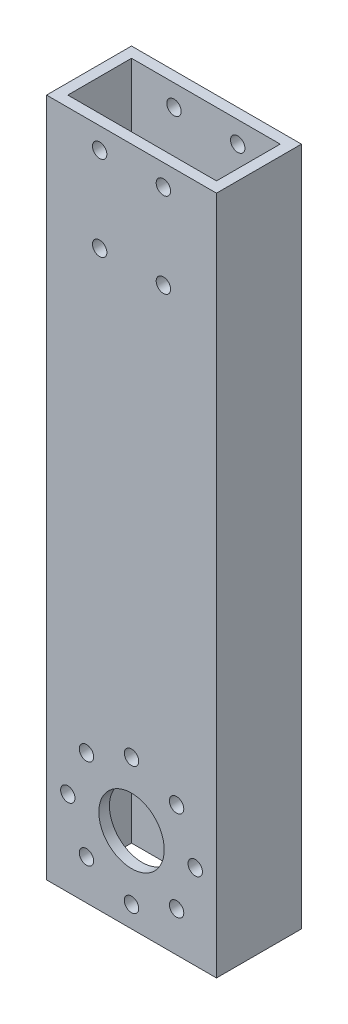
ISO-10303-21;
HEADER;
FILE_DESCRIPTION(('STEP AP214'),'2;1');
FILE_NAME('part.step','',(''),(''),'','','');
FILE_SCHEMA(('AUTOMOTIVE_DESIGN { 1 0 10303 214 1 1 1 1 }'));
ENDSEC;
DATA;
#1=APPLICATION_CONTEXT('core data for automotive mechanical design processes');
#2=APPLICATION_PROTOCOL_DEFINITION('international standard','automotive_design',2000,#1);
#3=PRODUCT_CONTEXT('',#1,'mechanical');
#4=PRODUCT('Part','Part','',(#3));
#5=PRODUCT_RELATED_PRODUCT_CATEGORY('part','',(#4));
#6=PRODUCT_DEFINITION_FORMATION('','',#4);
#7=PRODUCT_DEFINITION_CONTEXT('part definition',#1,'design');
#8=PRODUCT_DEFINITION('design','',#6,#7);
#9=PRODUCT_DEFINITION_SHAPE('','',#8);
#10=(LENGTH_UNIT() NAMED_UNIT(*) SI_UNIT(.MILLI.,.METRE.));
#11=(NAMED_UNIT(*) PLANE_ANGLE_UNIT() SI_UNIT($,.RADIAN.));
#12=(NAMED_UNIT(*) SI_UNIT($,.STERADIAN.) SOLID_ANGLE_UNIT());
#13=UNCERTAINTY_MEASURE_WITH_UNIT(LENGTH_MEASURE(1.E-05),#10,'distance_accuracy_value','');
#14=(GEOMETRIC_REPRESENTATION_CONTEXT(3) GLOBAL_UNCERTAINTY_ASSIGNED_CONTEXT((#13)) GLOBAL_UNIT_ASSIGNED_CONTEXT((#10,
#11,#12)) REPRESENTATION_CONTEXT('',''));
#15=CARTESIAN_POINT('',(0.,0.,0.));
#16=DIRECTION('',(0.,0.,1.));
#17=DIRECTION('',(1.,0.,0.));
#18=AXIS2_PLACEMENT_3D('',#15,#16,#17);
#19=CARTESIAN_POINT('',(-15.1862433862434,457.2,12.0280423280423));
#20=DIRECTION('',(1.,0.,0.));
#21=DIRECTION('',(0.,0.,-1.));
#22=AXIS2_PLACEMENT_3D('',#19,#20,#21);
#23=PLANE('',#22);
#24=DIRECTION('',(0.,-1.,0.));
#25=VECTOR('',#24,1.);
#26=CARTESIAN_POINT('',(-15.1862433862434,457.2,12.0280423280423));
#27=LINE('',#26,#25);
#28=CARTESIAN_POINT('',(-15.1862433862434,177.8,12.0280423280423));
#29=VERTEX_POINT('',#28);
#30=CARTESIAN_POINT('',(-15.1862433862434,-25.4,12.0280423280423));
#31=VERTEX_POINT('',#30);
#32=EDGE_CURVE('E66',#29,#31,#27,.T.);
#33=ORIENTED_EDGE('',*,*,#32,.F.);
#34=DIRECTION('',(0.,0.,1.));
#35=VECTOR('',#34,1.);
#36=CARTESIAN_POINT('',(-15.1862433862434,177.8,-13.3719576719577));
#37=LINE('',#36,#35);
#38=CARTESIAN_POINT('',(-15.1862433862434,177.8,-13.3719576719577));
#39=VERTEX_POINT('',#38);
#40=EDGE_CURVE('E123',#39,#29,#37,.T.);
#41=ORIENTED_EDGE('',*,*,#40,.F.);
#42=DIRECTION('',(0.,-1.,0.));
#43=VECTOR('',#42,1.);
#44=CARTESIAN_POINT('',(-15.1862433862434,457.2,-13.3719576719577));
#45=LINE('',#44,#43);
#46=CARTESIAN_POINT('',(-15.1862433862434,-25.4,-13.3719576719577));
#47=VERTEX_POINT('',#46);
#48=EDGE_CURVE('E132',#39,#47,#45,.T.);
#49=ORIENTED_EDGE('',*,*,#48,.T.);
#50=DIRECTION('',(0.,0.,-1.));
#51=VECTOR('',#50,1.);
#52=CARTESIAN_POINT('',(-15.1862433862434,-25.4,12.0280423280423));
#53=LINE('',#52,#51);
#54=EDGE_CURVE('E315',#31,#47,#53,.T.);
#55=ORIENTED_EDGE('',*,*,#54,.F.);
#56=EDGE_LOOP('',(#33,#41,#49,#55));
#57=FACE_BOUND('',#56,.T.);
#58=ADVANCED_FACE('F58',(#57),#23,.F.);
#59=CARTESIAN_POINT('',(-15.1862433862434,457.2,12.0280423280423));
#60=DIRECTION('',(0.,0.,-1.));
#61=DIRECTION('',(-1.,0.,0.));
#62=AXIS2_PLACEMENT_3D('',#59,#60,#61);
#63=PLANE('',#62);
#64=CARTESIAN_POINT('',(0.68875661375661,146.05,12.0280423280423));
#65=DIRECTION('',(0.,0.,-1.));
#66=DIRECTION('',(-1.,0.,0.));
#67=AXIS2_PLACEMENT_3D('',#64,#65,#66);
#68=CIRCLE('',#67,2.15265);
#69=CARTESIAN_POINT('',(-1.46389338624339,146.05,12.0280423280423));
#70=VERTEX_POINT('',#69);
#71=EDGE_CURVE('E650',#70,#70,#68,.T.);
#72=ORIENTED_EDGE('',*,*,#71,.T.);
#73=EDGE_LOOP('',(#72));
#74=FACE_BOUND('',#73,.T.);
#75=CARTESIAN_POINT('',(19.7387566137566,171.45,12.0280423280423));
#76=DIRECTION('',(0.,0.,-1.));
#77=DIRECTION('',(-1.,0.,0.));
#78=AXIS2_PLACEMENT_3D('',#75,#76,#77);
#79=CIRCLE('',#78,2.15265);
#80=CARTESIAN_POINT('',(17.5861066137566,171.45,12.0280423280423));
#81=VERTEX_POINT('',#80);
#82=EDGE_CURVE('E651',#81,#81,#79,.T.);
#83=ORIENTED_EDGE('',*,*,#82,.T.);
#84=EDGE_LOOP('',(#83));
#85=FACE_BOUND('',#84,.T.);
#86=CARTESIAN_POINT('',(0.68875661375661,171.45,12.0280423280423));
#87=DIRECTION('',(0.,0.,-1.));
#88=DIRECTION('',(-1.,0.,0.));
#89=AXIS2_PLACEMENT_3D('',#86,#87,#88);
#90=CIRCLE('',#89,2.15265);
#91=CARTESIAN_POINT('',(-1.46389338624339,171.45,12.0280423280423));
#92=VERTEX_POINT('',#91);
#93=EDGE_CURVE('E656',#92,#92,#90,.T.);
#94=ORIENTED_EDGE('',*,*,#93,.T.);
#95=EDGE_LOOP('',(#94));
#96=FACE_BOUND('',#95,.T.);
#97=CARTESIAN_POINT('',(19.7387566137566,146.05,12.0280423280423));
#98=DIRECTION('',(0.,0.,-1.));
#99=DIRECTION('',(-1.,0.,0.));
#100=AXIS2_PLACEMENT_3D('',#97,#98,#99);
#101=CIRCLE('',#100,2.15265);
#102=CARTESIAN_POINT('',(17.5861066137566,146.05,12.0280423280423));
#103=VERTEX_POINT('',#102);
#104=EDGE_CURVE('E192',#103,#103,#101,.T.);
#105=ORIENTED_EDGE('',*,*,#104,.T.);
#106=EDGE_LOOP('',(#105));
#107=FACE_BOUND('',#106,.T.);
#108=CARTESIAN_POINT('',(29.2637566137566,0.,12.0280423280423));
#109=DIRECTION('',(0.,0.,1.));
#110=DIRECTION('',(1.,0.,0.));
#111=AXIS2_PLACEMENT_3D('',#108,#109,#110);
#112=CIRCLE('',#111,2.15265);
#113=CARTESIAN_POINT('',(31.4164066137566,0.,12.0280423280423));
#114=VERTEX_POINT('',#113);
#115=EDGE_CURVE('E254',#114,#114,#112,.T.);
#116=ORIENTED_EDGE('',*,*,#115,.F.);
#117=EDGE_LOOP('',(#116));
#118=FACE_BOUND('',#117,.T.);
#119=CARTESIAN_POINT('',(23.6841407953603,13.4703841816038,12.0280423280423));
#120=DIRECTION('',(0.,0.,1.));
#121=DIRECTION('',(1.,0.,0.));
#122=AXIS2_PLACEMENT_3D('',#119,#120,#121);
#123=CIRCLE('',#122,2.15265);
#124=CARTESIAN_POINT('',(25.8367907953603,13.4703841816038,12.0280423280423));
#125=VERTEX_POINT('',#124);
#126=EDGE_CURVE('E262',#125,#125,#123,.T.);
#127=ORIENTED_EDGE('',*,*,#126,.F.);
#128=EDGE_LOOP('',(#127));
#129=FACE_BOUND('',#128,.T.);
#130=CARTESIAN_POINT('',(10.2137566137566,19.05,12.0280423280423));
#131=DIRECTION('',(0.,0.,1.));
#132=DIRECTION('',(1.,0.,0.));
#133=AXIS2_PLACEMENT_3D('',#130,#131,#132);
#134=CIRCLE('',#133,2.15265);
#135=CARTESIAN_POINT('',(12.3664066137566,19.05,12.0280423280423));
#136=VERTEX_POINT('',#135);
#137=EDGE_CURVE('E268',#136,#136,#134,.T.);
#138=ORIENTED_EDGE('',*,*,#137,.F.);
#139=EDGE_LOOP('',(#138));
#140=FACE_BOUND('',#139,.T.);
#141=CARTESIAN_POINT('',(-3.2566275678471,13.4703841816038,12.0280423280423));
#142=DIRECTION('',(0.,0.,1.));
#143=DIRECTION('',(1.,0.,0.));
#144=AXIS2_PLACEMENT_3D('',#141,#142,#143);
#145=CIRCLE('',#144,2.15265000000001);
#146=CARTESIAN_POINT('',(-1.10397756784709,13.4703841816038,12.0280423280423));
#147=VERTEX_POINT('',#146);
#148=EDGE_CURVE('E237',#147,#147,#145,.T.);
#149=ORIENTED_EDGE('',*,*,#148,.F.);
#150=EDGE_LOOP('',(#149));
#151=FACE_BOUND('',#150,.T.);
#152=CARTESIAN_POINT('',(-8.83624338624339,0.,12.0280423280423));
#153=DIRECTION('',(0.,0.,1.));
#154=DIRECTION('',(1.,0.,0.));
#155=AXIS2_PLACEMENT_3D('',#152,#153,#154);
#156=CIRCLE('',#155,2.15265);
#157=CARTESIAN_POINT('',(-6.68359338624339,0.,12.0280423280423));
#158=VERTEX_POINT('',#157);
#159=EDGE_CURVE('E230',#158,#158,#156,.T.);
#160=ORIENTED_EDGE('',*,*,#159,.F.);
#161=EDGE_LOOP('',(#160));
#162=FACE_BOUND('',#161,.T.);
#163=CARTESIAN_POINT('',(-3.25662756784704,-13.4703841816038,12.0280423280423));
#164=DIRECTION('',(0.,0.,1.));
#165=DIRECTION('',(1.,0.,0.));
#166=AXIS2_PLACEMENT_3D('',#163,#164,#165);
#167=CIRCLE('',#166,2.15264999999999);
#168=CARTESIAN_POINT('',(-1.10397756784705,-13.4703841816038,12.0280423280423));
#169=VERTEX_POINT('',#168);
#170=EDGE_CURVE('E238',#169,#169,#167,.T.);
#171=ORIENTED_EDGE('',*,*,#170,.F.);
#172=EDGE_LOOP('',(#171));
#173=FACE_BOUND('',#172,.T.);
#174=CARTESIAN_POINT('',(10.2137566137566,-19.05,12.0280423280423));
#175=DIRECTION('',(0.,0.,1.));
#176=DIRECTION('',(1.,0.,0.));
#177=AXIS2_PLACEMENT_3D('',#174,#175,#176);
#178=CIRCLE('',#177,2.15265);
#179=CARTESIAN_POINT('',(12.3664066137566,-19.05,12.0280423280423));
#180=VERTEX_POINT('',#179);
#181=EDGE_CURVE('E244',#180,#180,#178,.T.);
#182=ORIENTED_EDGE('',*,*,#181,.F.);
#183=EDGE_LOOP('',(#182));
#184=FACE_BOUND('',#183,.T.);
#185=CARTESIAN_POINT('',(23.6841407953603,-13.4703841816037,12.0280423280423));
#186=DIRECTION('',(0.,0.,1.));
#187=DIRECTION('',(1.,0.,0.));
#188=AXIS2_PLACEMENT_3D('',#185,#186,#187);
#189=CIRCLE('',#188,2.15265);
#190=CARTESIAN_POINT('',(25.8367907953603,-13.4703841816037,12.0280423280423));
#191=VERTEX_POINT('',#190);
#192=EDGE_CURVE('E229',#191,#191,#189,.T.);
#193=ORIENTED_EDGE('',*,*,#192,.F.);
#194=EDGE_LOOP('',(#193));
#195=FACE_BOUND('',#194,.T.);
#196=CARTESIAN_POINT('',(10.2137566137566,0.,12.0280423280423));
#197=DIRECTION('',(0.,0.,1.));
#198=DIRECTION('',(1.,0.,0.));
#199=AXIS2_PLACEMENT_3D('',#196,#197,#198);
#200=CIRCLE('',#199,9.779);
#201=CARTESIAN_POINT('',(19.9927566137566,0.,12.0280423280423));
#202=VERTEX_POINT('',#201);
#203=EDGE_CURVE('E261',#202,#202,#200,.T.);
#204=ORIENTED_EDGE('',*,*,#203,.F.);
#205=EDGE_LOOP('',(#204));
#206=FACE_BOUND('',#205,.T.);
#207=DIRECTION('',(0.,-1.,0.));
#208=VECTOR('',#207,1.);
#209=CARTESIAN_POINT('',(35.6137566137566,457.2,12.0280423280423));
#210=LINE('',#209,#208);
#211=CARTESIAN_POINT('',(35.6137566137566,177.8,12.0280423280423));
#212=VERTEX_POINT('',#211);
#213=CARTESIAN_POINT('',(35.6137566137566,-25.4,12.0280423280423));
#214=VERTEX_POINT('',#213);
#215=EDGE_CURVE('E143',#212,#214,#210,.T.);
#216=ORIENTED_EDGE('',*,*,#215,.F.);
#217=DIRECTION('',(1.,0.,0.));
#218=VECTOR('',#217,1.);
#219=CARTESIAN_POINT('',(35.6137566137566,177.8,12.0280423280423));
#220=LINE('',#219,#218);
#221=EDGE_CURVE('E134',#29,#212,#220,.T.);
#222=ORIENTED_EDGE('',*,*,#221,.F.);
#223=ORIENTED_EDGE('',*,*,#32,.T.);
#224=DIRECTION('',(-1.,0.,0.));
#225=VECTOR('',#224,1.);
#226=CARTESIAN_POINT('',(35.6137566137566,-25.4,12.0280423280423));
#227=LINE('',#226,#225);
#228=EDGE_CURVE('E312',#214,#31,#227,.T.);
#229=ORIENTED_EDGE('',*,*,#228,.F.);
#230=EDGE_LOOP('',(#216,#222,#223,#229));
#231=FACE_BOUND('',#230,.T.);
#232=ADVANCED_FACE('F364',(#74,#85,#96,#107,#118,#129,#140,#151,#162,#173,#184,#195,#206,#231),
#63,.F.);
#233=CARTESIAN_POINT('',(35.6137566137566,457.2,12.0280423280423));
#234=DIRECTION('',(-1.,0.,0.));
#235=DIRECTION('',(0.,0.,1.));
#236=AXIS2_PLACEMENT_3D('',#233,#234,#235);
#237=PLANE('',#236);
#238=DIRECTION('',(0.,-1.,0.));
#239=VECTOR('',#238,1.);
#240=CARTESIAN_POINT('',(35.6137566137566,457.2,-13.3719576719577));
#241=LINE('',#240,#239);
#242=CARTESIAN_POINT('',(35.6137566137566,177.8,-13.3719576719577));
#243=VERTEX_POINT('',#242);
#244=CARTESIAN_POINT('',(35.6137566137566,-25.4,-13.3719576719577));
#245=VERTEX_POINT('',#244);
#246=EDGE_CURVE('E140',#243,#245,#241,.T.);
#247=ORIENTED_EDGE('',*,*,#246,.F.);
#248=DIRECTION('',(0.,0.,-1.));
#249=VECTOR('',#248,1.);
#250=CARTESIAN_POINT('',(35.6137566137566,177.8,-13.3719576719577));
#251=LINE('',#250,#249);
#252=EDGE_CURVE('E74',#212,#243,#251,.T.);
#253=ORIENTED_EDGE('',*,*,#252,.F.);
#254=ORIENTED_EDGE('',*,*,#215,.T.);
#255=DIRECTION('',(0.,0.,1.));
#256=VECTOR('',#255,1.);
#257=CARTESIAN_POINT('',(35.6137566137566,-25.4,-13.3719576719577));
#258=LINE('',#257,#256);
#259=EDGE_CURVE('E318',#245,#214,#258,.T.);
#260=ORIENTED_EDGE('',*,*,#259,.F.);
#261=EDGE_LOOP('',(#247,#253,#254,#260));
#262=FACE_BOUND('',#261,.T.);
#263=ADVANCED_FACE('F368',(#262),#237,.F.);
#264=CARTESIAN_POINT('',(-15.1862433862434,457.2,-13.3719576719577));
#265=DIRECTION('',(0.,0.,1.));
#266=DIRECTION('',(1.,0.,0.));
#267=AXIS2_PLACEMENT_3D('',#264,#265,#266);
#268=PLANE('',#267);
#269=CARTESIAN_POINT('',(0.68875661375661,146.05,-13.3719576719577));
#270=DIRECTION('',(0.,0.,1.));
#271=DIRECTION('',(1.,0.,0.));
#272=AXIS2_PLACEMENT_3D('',#269,#270,#271);
#273=CIRCLE('',#272,2.15265);
#274=CARTESIAN_POINT('',(2.84140661375661,146.05,-13.3719576719577));
#275=VERTEX_POINT('',#274);
#276=EDGE_CURVE('E219',#275,#275,#273,.T.);
#277=ORIENTED_EDGE('',*,*,#276,.T.);
#278=EDGE_LOOP('',(#277));
#279=FACE_BOUND('',#278,.T.);
#280=CARTESIAN_POINT('',(19.7387566137566,171.45,-13.3719576719577));
#281=DIRECTION('',(0.,0.,1.));
#282=DIRECTION('',(1.,0.,0.));
#283=AXIS2_PLACEMENT_3D('',#280,#281,#282);
#284=CIRCLE('',#283,2.15265);
#285=CARTESIAN_POINT('',(21.8914066137566,171.45,-13.3719576719577));
#286=VERTEX_POINT('',#285);
#287=EDGE_CURVE('E204',#286,#286,#284,.T.);
#288=ORIENTED_EDGE('',*,*,#287,.T.);
#289=EDGE_LOOP('',(#288));
#290=FACE_BOUND('',#289,.T.);
#291=CARTESIAN_POINT('',(0.68875661375661,171.45,-13.3719576719577));
#292=DIRECTION('',(0.,0.,1.));
#293=DIRECTION('',(1.,0.,0.));
#294=AXIS2_PLACEMENT_3D('',#291,#292,#293);
#295=CIRCLE('',#294,2.15265);
#296=CARTESIAN_POINT('',(2.84140661375661,171.45,-13.3719576719577));
#297=VERTEX_POINT('',#296);
#298=EDGE_CURVE('E200',#297,#297,#295,.T.);
#299=ORIENTED_EDGE('',*,*,#298,.T.);
#300=EDGE_LOOP('',(#299));
#301=FACE_BOUND('',#300,.T.);
#302=CARTESIAN_POINT('',(19.7387566137566,146.05,-13.3719576719577));
#303=DIRECTION('',(0.,0.,1.));
#304=DIRECTION('',(1.,0.,0.));
#305=AXIS2_PLACEMENT_3D('',#302,#303,#304);
#306=CIRCLE('',#305,2.15265);
#307=CARTESIAN_POINT('',(21.8914066137566,146.05,-13.3719576719577));
#308=VERTEX_POINT('',#307);
#309=EDGE_CURVE('E196',#308,#308,#306,.T.);
#310=ORIENTED_EDGE('',*,*,#309,.T.);
#311=EDGE_LOOP('',(#310));
#312=FACE_BOUND('',#311,.T.);
#313=CARTESIAN_POINT('',(29.2637566137566,0.,-13.3719576719577));
#314=DIRECTION('',(0.,0.,1.));
#315=DIRECTION('',(1.,0.,0.));
#316=AXIS2_PLACEMENT_3D('',#313,#314,#315);
#317=CIRCLE('',#316,2.15265);
#318=CARTESIAN_POINT('',(31.4164066137566,0.,-13.3719576719577));
#319=VERTEX_POINT('',#318);
#320=EDGE_CURVE('E257',#319,#319,#317,.F.);
#321=ORIENTED_EDGE('',*,*,#320,.F.);
#322=EDGE_LOOP('',(#321));
#323=FACE_BOUND('',#322,.T.);
#324=CARTESIAN_POINT('',(23.6841407953603,13.4703841816038,-13.3719576719577));
#325=DIRECTION('',(0.,0.,1.));
#326=DIRECTION('',(1.,0.,0.));
#327=AXIS2_PLACEMENT_3D('',#324,#325,#326);
#328=CIRCLE('',#327,2.15265);
#329=CARTESIAN_POINT('',(25.8367907953603,13.4703841816038,-13.3719576719577));
#330=VERTEX_POINT('',#329);
#331=EDGE_CURVE('E258',#330,#330,#328,.F.);
#332=ORIENTED_EDGE('',*,*,#331,.F.);
#333=EDGE_LOOP('',(#332));
#334=FACE_BOUND('',#333,.T.);
#335=CARTESIAN_POINT('',(10.2137566137566,19.05,-13.3719576719577));
#336=DIRECTION('',(0.,0.,1.));
#337=DIRECTION('',(1.,0.,0.));
#338=AXIS2_PLACEMENT_3D('',#335,#336,#337);
#339=CIRCLE('',#338,2.15265);
#340=CARTESIAN_POINT('',(12.3664066137566,19.05,-13.3719576719577));
#341=VERTEX_POINT('',#340);
#342=EDGE_CURVE('E265',#341,#341,#339,.F.);
#343=ORIENTED_EDGE('',*,*,#342,.F.);
#344=EDGE_LOOP('',(#343));
#345=FACE_BOUND('',#344,.T.);
#346=CARTESIAN_POINT('',(-3.2566275678471,13.4703841816038,-13.3719576719577));
#347=DIRECTION('',(0.,0.,1.));
#348=DIRECTION('',(1.,0.,0.));
#349=AXIS2_PLACEMENT_3D('',#346,#347,#348);
#350=CIRCLE('',#349,2.15265000000001);
#351=CARTESIAN_POINT('',(-1.10397756784709,13.4703841816038,-13.3719576719577));
#352=VERTEX_POINT('',#351);
#353=EDGE_CURVE('E271',#352,#352,#350,.F.);
#354=ORIENTED_EDGE('',*,*,#353,.F.);
#355=EDGE_LOOP('',(#354));
#356=FACE_BOUND('',#355,.T.);
#357=CARTESIAN_POINT('',(-8.83624338624339,0.,-13.3719576719577));
#358=DIRECTION('',(0.,0.,1.));
#359=DIRECTION('',(1.,0.,0.));
#360=AXIS2_PLACEMENT_3D('',#357,#358,#359);
#361=CIRCLE('',#360,2.15265);
#362=CARTESIAN_POINT('',(-6.68359338624339,0.,-13.3719576719577));
#363=VERTEX_POINT('',#362);
#364=EDGE_CURVE('E233',#363,#363,#361,.F.);
#365=ORIENTED_EDGE('',*,*,#364,.F.);
#366=EDGE_LOOP('',(#365));
#367=FACE_BOUND('',#366,.T.);
#368=CARTESIAN_POINT('',(-3.25662756784704,-13.4703841816038,-13.3719576719577));
#369=DIRECTION('',(0.,0.,1.));
#370=DIRECTION('',(1.,0.,0.));
#371=AXIS2_PLACEMENT_3D('',#368,#369,#370);
#372=CIRCLE('',#371,2.15264999999999);
#373=CARTESIAN_POINT('',(-1.10397756784705,-13.4703841816038,-13.3719576719577));
#374=VERTEX_POINT('',#373);
#375=EDGE_CURVE('E234',#374,#374,#372,.F.);
#376=ORIENTED_EDGE('',*,*,#375,.F.);
#377=EDGE_LOOP('',(#376));
#378=FACE_BOUND('',#377,.T.);
#379=CARTESIAN_POINT('',(10.2137566137566,-19.05,-13.3719576719577));
#380=DIRECTION('',(0.,0.,1.));
#381=DIRECTION('',(1.,0.,0.));
#382=AXIS2_PLACEMENT_3D('',#379,#380,#381);
#383=CIRCLE('',#382,2.15265);
#384=CARTESIAN_POINT('',(12.3664066137566,-19.05,-13.3719576719577));
#385=VERTEX_POINT('',#384);
#386=EDGE_CURVE('E241',#385,#385,#383,.F.);
#387=ORIENTED_EDGE('',*,*,#386,.F.);
#388=EDGE_LOOP('',(#387));
#389=FACE_BOUND('',#388,.T.);
#390=CARTESIAN_POINT('',(23.6841407953603,-13.4703841816037,-13.3719576719577));
#391=DIRECTION('',(0.,0.,1.));
#392=DIRECTION('',(1.,0.,0.));
#393=AXIS2_PLACEMENT_3D('',#390,#391,#392);
#394=CIRCLE('',#393,2.15265);
#395=CARTESIAN_POINT('',(25.8367907953603,-13.4703841816037,-13.3719576719577));
#396=VERTEX_POINT('',#395);
#397=EDGE_CURVE('E247',#396,#396,#394,.F.);
#398=ORIENTED_EDGE('',*,*,#397,.F.);
#399=EDGE_LOOP('',(#398));
#400=FACE_BOUND('',#399,.T.);
#401=CARTESIAN_POINT('',(10.2137566137566,0.,-13.3719576719577));
#402=DIRECTION('',(0.,0.,1.));
#403=DIRECTION('',(1.,0.,0.));
#404=AXIS2_PLACEMENT_3D('',#401,#402,#403);
#405=CIRCLE('',#404,9.779);
#406=CARTESIAN_POINT('',(19.9927566137566,0.,-13.3719576719577));
#407=VERTEX_POINT('',#406);
#408=EDGE_CURVE('E155',#407,#407,#405,.F.);
#409=ORIENTED_EDGE('',*,*,#408,.F.);
#410=EDGE_LOOP('',(#409));
#411=FACE_BOUND('',#410,.T.);
#412=ORIENTED_EDGE('',*,*,#48,.F.);
#413=DIRECTION('',(-1.,0.,0.));
#414=VECTOR('',#413,1.);
#415=CARTESIAN_POINT('',(35.6137566137566,177.8,-13.3719576719577));
#416=LINE('',#415,#414);
#417=EDGE_CURVE('E120',#243,#39,#416,.T.);
#418=ORIENTED_EDGE('',*,*,#417,.F.);
#419=ORIENTED_EDGE('',*,*,#246,.T.);
#420=DIRECTION('',(1.,0.,0.));
#421=VECTOR('',#420,1.);
#422=CARTESIAN_POINT('',(-15.1862433862434,-25.4,-13.3719576719577));
#423=LINE('',#422,#421);
#424=EDGE_CURVE('E139',#47,#245,#423,.T.);
#425=ORIENTED_EDGE('',*,*,#424,.F.);
#426=EDGE_LOOP('',(#412,#418,#419,#425));
#427=FACE_BOUND('',#426,.T.);
#428=ADVANCED_FACE('F137',(#279,#290,#301,#312,#323,#334,#345,#356,#367,#378,#389,#400,#411,
#427),#268,.F.);
#429=CARTESIAN_POINT('',(-12.0112433862434,457.2,0.));
#430=DIRECTION('',(1.,0.,0.));
#431=DIRECTION('',(0.,0.,-1.));
#432=AXIS2_PLACEMENT_3D('',#429,#430,#431);
#433=PLANE('',#432);
#434=DIRECTION('',(0.,0.,-1.));
#435=VECTOR('',#434,1.);
#436=CARTESIAN_POINT('',(-12.0112433862434,177.8,0.));
#437=LINE('',#436,#435);
#438=CARTESIAN_POINT('',(-12.0112433862434,177.8,8.85304232804233));
#439=VERTEX_POINT('',#438);
#440=CARTESIAN_POINT('',(-12.0112433862434,177.8,-10.1969576719577));
#441=VERTEX_POINT('',#440);
#442=EDGE_CURVE('E81',#439,#441,#437,.T.);
#443=ORIENTED_EDGE('',*,*,#442,.F.);
#444=DIRECTION('',(0.,-1.,0.));
#445=VECTOR('',#444,1.);
#446=CARTESIAN_POINT('',(-12.0112433862434,457.2,8.85304232804233));
#447=LINE('',#446,#445);
#448=CARTESIAN_POINT('',(-12.0112433862434,-25.4,8.85304232804233));
#449=VERTEX_POINT('',#448);
#450=EDGE_CURVE('E141',#439,#449,#447,.T.);
#451=ORIENTED_EDGE('',*,*,#450,.T.);
#452=DIRECTION('',(0.,0.,-1.));
#453=VECTOR('',#452,1.);
#454=CARTESIAN_POINT('',(-12.0112433862434,-25.4,-10.1969576719577));
#455=LINE('',#454,#453);
#456=CARTESIAN_POINT('',(-12.0112433862434,-25.4,-10.1969576719577));
#457=VERTEX_POINT('',#456);
#458=EDGE_CURVE('E309',#449,#457,#455,.T.);
#459=ORIENTED_EDGE('',*,*,#458,.T.);
#460=DIRECTION('',(0.,-1.,0.));
#461=VECTOR('',#460,1.);
#462=CARTESIAN_POINT('',(-12.0112433862434,457.2,-10.1969576719577));
#463=LINE('',#462,#461);
#464=EDGE_CURVE('E321',#441,#457,#463,.T.);
#465=ORIENTED_EDGE('',*,*,#464,.F.);
#466=EDGE_LOOP('',(#443,#451,#459,#465));
#467=FACE_BOUND('',#466,.T.);
#468=ADVANCED_FACE('F342',(#467),#433,.T.);
#469=CARTESIAN_POINT('',(0.,457.2,8.85304232804233));
#470=DIRECTION('',(0.,0.,-1.));
#471=DIRECTION('',(-1.,0.,0.));
#472=AXIS2_PLACEMENT_3D('',#469,#470,#471);
#473=PLANE('',#472);
#474=CARTESIAN_POINT('',(0.68875661375661,146.05,8.85304232804233));
#475=DIRECTION('',(0.,0.,-1.));
#476=DIRECTION('',(-1.,0.,0.));
#477=AXIS2_PLACEMENT_3D('',#474,#475,#476);
#478=CIRCLE('',#477,2.15265);
#479=CARTESIAN_POINT('',(-1.46389338624339,146.05,8.85304232804233));
#480=VERTEX_POINT('',#479);
#481=EDGE_CURVE('E216',#480,#480,#478,.T.);
#482=ORIENTED_EDGE('',*,*,#481,.F.);
#483=EDGE_LOOP('',(#482));
#484=FACE_BOUND('',#483,.T.);
#485=CARTESIAN_POINT('',(19.7387566137566,171.45,8.85304232804233));
#486=DIRECTION('',(0.,0.,-1.));
#487=DIRECTION('',(-1.,0.,0.));
#488=AXIS2_PLACEMENT_3D('',#485,#486,#487);
#489=CIRCLE('',#488,2.15265);
#490=CARTESIAN_POINT('',(17.5861066137566,171.45,8.85304232804233));
#491=VERTEX_POINT('',#490);
#492=EDGE_CURVE('E199',#491,#491,#489,.T.);
#493=ORIENTED_EDGE('',*,*,#492,.F.);
#494=EDGE_LOOP('',(#493));
#495=FACE_BOUND('',#494,.T.);
#496=CARTESIAN_POINT('',(0.68875661375661,171.45,8.85304232804233));
#497=DIRECTION('',(0.,0.,-1.));
#498=DIRECTION('',(-1.,0.,0.));
#499=AXIS2_PLACEMENT_3D('',#496,#497,#498);
#500=CIRCLE('',#499,2.15265);
#501=CARTESIAN_POINT('',(-1.46389338624339,171.45,8.85304232804233));
#502=VERTEX_POINT('',#501);
#503=EDGE_CURVE('E195',#502,#502,#500,.T.);
#504=ORIENTED_EDGE('',*,*,#503,.F.);
#505=EDGE_LOOP('',(#504));
#506=FACE_BOUND('',#505,.T.);
#507=CARTESIAN_POINT('',(19.7387566137566,146.05,8.85304232804233));
#508=DIRECTION('',(0.,0.,-1.));
#509=DIRECTION('',(-1.,0.,0.));
#510=AXIS2_PLACEMENT_3D('',#507,#508,#509);
#511=CIRCLE('',#510,2.15265);
#512=CARTESIAN_POINT('',(17.5861066137566,146.05,8.85304232804233));
#513=VERTEX_POINT('',#512);
#514=EDGE_CURVE('E191',#513,#513,#511,.T.);
#515=ORIENTED_EDGE('',*,*,#514,.F.);
#516=EDGE_LOOP('',(#515));
#517=FACE_BOUND('',#516,.T.);
#518=DIRECTION('',(-1.,0.,0.));
#519=VECTOR('',#518,1.);
#520=CARTESIAN_POINT('',(0.,177.8,8.85304232804233));
#521=LINE('',#520,#519);
#522=CARTESIAN_POINT('',(32.4387566137566,177.8,8.85304232804233));
#523=VERTEX_POINT('',#522);
#524=EDGE_CURVE('E226',#523,#439,#521,.T.);
#525=ORIENTED_EDGE('',*,*,#524,.F.);
#526=DIRECTION('',(0.,-1.,0.));
#527=VECTOR('',#526,1.);
#528=CARTESIAN_POINT('',(32.4387566137566,457.2,8.85304232804233));
#529=LINE('',#528,#527);
#530=CARTESIAN_POINT('',(32.4387566137566,-25.4,8.85304232804233));
#531=VERTEX_POINT('',#530);
#532=EDGE_CURVE('E145',#523,#531,#529,.T.);
#533=ORIENTED_EDGE('',*,*,#532,.T.);
#534=DIRECTION('',(-1.,0.,0.));
#535=VECTOR('',#534,1.);
#536=CARTESIAN_POINT('',(-12.0112433862434,-25.4,8.85304232804233));
#537=LINE('',#536,#535);
#538=EDGE_CURVE('E306',#531,#449,#537,.T.);
#539=ORIENTED_EDGE('',*,*,#538,.T.);
#540=ORIENTED_EDGE('',*,*,#450,.F.);
#541=EDGE_LOOP('',(#525,#533,#539,#540));
#542=FACE_BOUND('',#541,.T.);
#543=CARTESIAN_POINT('',(29.2637566137566,0.,8.85304232804233));
#544=DIRECTION('',(0.,0.,-1.));
#545=DIRECTION('',(-1.,0.,0.));
#546=AXIS2_PLACEMENT_3D('',#543,#544,#545);
#547=CIRCLE('',#546,2.15265);
#548=CARTESIAN_POINT('',(27.1111066137566,0.,8.85304232804233));
#549=VERTEX_POINT('',#548);
#550=EDGE_CURVE('E186',#549,#549,#547,.T.);
#551=ORIENTED_EDGE('',*,*,#550,.F.);
#552=EDGE_LOOP('',(#551));
#553=FACE_BOUND('',#552,.T.);
#554=CARTESIAN_POINT('',(23.6841407953603,13.4703841816038,8.85304232804233));
#555=DIRECTION('',(0.,0.,-1.));
#556=DIRECTION('',(-1.,0.,0.));
#557=AXIS2_PLACEMENT_3D('',#554,#555,#556);
#558=CIRCLE('',#557,2.15265);
#559=CARTESIAN_POINT('',(21.5314907953603,13.4703841816038,8.85304232804233));
#560=VERTEX_POINT('',#559);
#561=EDGE_CURVE('E183',#560,#560,#558,.T.);
#562=ORIENTED_EDGE('',*,*,#561,.F.);
#563=EDGE_LOOP('',(#562));
#564=FACE_BOUND('',#563,.T.);
#565=CARTESIAN_POINT('',(10.2137566137566,19.05,8.85304232804233));
#566=DIRECTION('',(0.,0.,-1.));
#567=DIRECTION('',(-1.,0.,0.));
#568=AXIS2_PLACEMENT_3D('',#565,#566,#567);
#569=CIRCLE('',#568,2.15265);
#570=CARTESIAN_POINT('',(8.06110661375661,19.05,8.85304232804233));
#571=VERTEX_POINT('',#570);
#572=EDGE_CURVE('E179',#571,#571,#569,.T.);
#573=ORIENTED_EDGE('',*,*,#572,.F.);
#574=EDGE_LOOP('',(#573));
#575=FACE_BOUND('',#574,.T.);
#576=CARTESIAN_POINT('',(-3.2566275678471,13.4703841816038,8.85304232804233));
#577=DIRECTION('',(0.,0.,-1.));
#578=DIRECTION('',(-1.,0.,0.));
#579=AXIS2_PLACEMENT_3D('',#576,#577,#578);
#580=CIRCLE('',#579,2.15265000000001);
#581=CARTESIAN_POINT('',(-5.4092775678471,13.4703841816038,8.85304232804233));
#582=VERTEX_POINT('',#581);
#583=EDGE_CURVE('E175',#582,#582,#580,.T.);
#584=ORIENTED_EDGE('',*,*,#583,.F.);
#585=EDGE_LOOP('',(#584));
#586=FACE_BOUND('',#585,.T.);
#587=CARTESIAN_POINT('',(-8.83624338624339,0.,8.85304232804233));
#588=DIRECTION('',(0.,0.,-1.));
#589=DIRECTION('',(-1.,0.,0.));
#590=AXIS2_PLACEMENT_3D('',#587,#588,#589);
#591=CIRCLE('',#590,2.15265);
#592=CARTESIAN_POINT('',(-10.9888933862434,0.,8.85304232804233));
#593=VERTEX_POINT('',#592);
#594=EDGE_CURVE('E171',#593,#593,#591,.T.);
#595=ORIENTED_EDGE('',*,*,#594,.F.);
#596=EDGE_LOOP('',(#595));
#597=FACE_BOUND('',#596,.T.);
#598=CARTESIAN_POINT('',(-3.25662756784704,-13.4703841816038,8.85304232804233));
#599=DIRECTION('',(0.,0.,-1.));
#600=DIRECTION('',(-1.,0.,0.));
#601=AXIS2_PLACEMENT_3D('',#598,#599,#600);
#602=CIRCLE('',#601,2.15264999999999);
#603=CARTESIAN_POINT('',(-5.40927756784703,-13.4703841816038,8.85304232804233));
#604=VERTEX_POINT('',#603);
#605=EDGE_CURVE('E167',#604,#604,#602,.T.);
#606=ORIENTED_EDGE('',*,*,#605,.F.);
#607=EDGE_LOOP('',(#606));
#608=FACE_BOUND('',#607,.T.);
#609=CARTESIAN_POINT('',(10.2137566137566,-19.05,8.85304232804233));
#610=DIRECTION('',(0.,0.,-1.));
#611=DIRECTION('',(-1.,0.,0.));
#612=AXIS2_PLACEMENT_3D('',#609,#610,#611);
#613=CIRCLE('',#612,2.15265);
#614=CARTESIAN_POINT('',(8.06110661375661,-19.05,8.85304232804233));
#615=VERTEX_POINT('',#614);
#616=EDGE_CURVE('E163',#615,#615,#613,.T.);
#617=ORIENTED_EDGE('',*,*,#616,.F.);
#618=EDGE_LOOP('',(#617));
#619=FACE_BOUND('',#618,.T.);
#620=CARTESIAN_POINT('',(23.6841407953603,-13.4703841816037,8.85304232804233));
#621=DIRECTION('',(0.,0.,-1.));
#622=DIRECTION('',(-1.,0.,0.));
#623=AXIS2_PLACEMENT_3D('',#620,#621,#622);
#624=CIRCLE('',#623,2.15265);
#625=CARTESIAN_POINT('',(21.5314907953603,-13.4703841816037,8.85304232804233));
#626=VERTEX_POINT('',#625);
#627=EDGE_CURVE('E159',#626,#626,#624,.T.);
#628=ORIENTED_EDGE('',*,*,#627,.F.);
#629=EDGE_LOOP('',(#628));
#630=FACE_BOUND('',#629,.T.);
#631=CARTESIAN_POINT('',(10.2137566137566,0.,8.85304232804233));
#632=DIRECTION('',(0.,0.,-1.));
#633=DIRECTION('',(-1.,0.,0.));
#634=AXIS2_PLACEMENT_3D('',#631,#632,#633);
#635=CIRCLE('',#634,9.779);
#636=CARTESIAN_POINT('',(0.434756613756615,0.,8.85304232804233));
#637=VERTEX_POINT('',#636);
#638=EDGE_CURVE('E154',#637,#637,#635,.T.);
#639=ORIENTED_EDGE('',*,*,#638,.F.);
#640=EDGE_LOOP('',(#639));
#641=FACE_BOUND('',#640,.T.);
#642=ADVANCED_FACE('F327',(#484,#495,#506,#517,#542,#553,#564,#575,#586,#597,#608,#619,#630,
#641),#473,.T.);
#643=CARTESIAN_POINT('',(32.4387566137566,457.2,0.));
#644=DIRECTION('',(-1.,0.,0.));
#645=DIRECTION('',(0.,0.,1.));
#646=AXIS2_PLACEMENT_3D('',#643,#644,#645);
#647=PLANE('',#646);
#648=DIRECTION('',(0.,0.,1.));
#649=VECTOR('',#648,1.);
#650=CARTESIAN_POINT('',(32.4387566137566,177.8,0.));
#651=LINE('',#650,#649);
#652=CARTESIAN_POINT('',(32.4387566137566,177.8,-10.1969576719577));
#653=VERTEX_POINT('',#652);
#654=EDGE_CURVE('E224',#653,#523,#651,.T.);
#655=ORIENTED_EDGE('',*,*,#654,.F.);
#656=DIRECTION('',(0.,-1.,0.));
#657=VECTOR('',#656,1.);
#658=CARTESIAN_POINT('',(32.4387566137566,457.2,-10.1969576719577));
#659=LINE('',#658,#657);
#660=CARTESIAN_POINT('',(32.4387566137566,-25.4,-10.1969576719577));
#661=VERTEX_POINT('',#660);
#662=EDGE_CURVE('E323',#653,#661,#659,.T.);
#663=ORIENTED_EDGE('',*,*,#662,.T.);
#664=DIRECTION('',(0.,0.,1.));
#665=VECTOR('',#664,1.);
#666=CARTESIAN_POINT('',(32.4387566137566,-25.4,8.85304232804233));
#667=LINE('',#666,#665);
#668=EDGE_CURVE('E303',#661,#531,#667,.T.);
#669=ORIENTED_EDGE('',*,*,#668,.T.);
#670=ORIENTED_EDGE('',*,*,#532,.F.);
#671=EDGE_LOOP('',(#655,#663,#669,#670));
#672=FACE_BOUND('',#671,.T.);
#673=ADVANCED_FACE('F335',(#672),#647,.T.);
#674=CARTESIAN_POINT('',(0.,457.2,-10.1969576719577));
#675=DIRECTION('',(0.,0.,1.));
#676=DIRECTION('',(1.,0.,0.));
#677=AXIS2_PLACEMENT_3D('',#674,#675,#676);
#678=PLANE('',#677);
#679=CARTESIAN_POINT('',(0.68875661375661,146.05,-10.1969576719577));
#680=DIRECTION('',(0.,0.,1.));
#681=DIRECTION('',(1.,0.,0.));
#682=AXIS2_PLACEMENT_3D('',#679,#680,#681);
#683=CIRCLE('',#682,2.15265);
#684=CARTESIAN_POINT('',(2.84140661375661,146.05,-10.1969576719577));
#685=VERTEX_POINT('',#684);
#686=EDGE_CURVE('E61',#685,#685,#683,.T.);
#687=ORIENTED_EDGE('',*,*,#686,.F.);
#688=EDGE_LOOP('',(#687));
#689=FACE_BOUND('',#688,.T.);
#690=CARTESIAN_POINT('',(19.7387566137566,171.45,-10.1969576719577));
#691=DIRECTION('',(0.,0.,1.));
#692=DIRECTION('',(1.,0.,0.));
#693=AXIS2_PLACEMENT_3D('',#690,#691,#692);
#694=CIRCLE('',#693,2.15265);
#695=CARTESIAN_POINT('',(21.8914066137566,171.45,-10.1969576719577));
#696=VERTEX_POINT('',#695);
#697=EDGE_CURVE('E197',#696,#696,#694,.T.);
#698=ORIENTED_EDGE('',*,*,#697,.F.);
#699=EDGE_LOOP('',(#698));
#700=FACE_BOUND('',#699,.T.);
#701=CARTESIAN_POINT('',(0.68875661375661,171.45,-10.1969576719577));
#702=DIRECTION('',(0.,0.,1.));
#703=DIRECTION('',(1.,0.,0.));
#704=AXIS2_PLACEMENT_3D('',#701,#702,#703);
#705=CIRCLE('',#704,2.15265);
#706=CARTESIAN_POINT('',(2.84140661375661,171.45,-10.1969576719577));
#707=VERTEX_POINT('',#706);
#708=EDGE_CURVE('E193',#707,#707,#705,.T.);
#709=ORIENTED_EDGE('',*,*,#708,.F.);
#710=EDGE_LOOP('',(#709));
#711=FACE_BOUND('',#710,.T.);
#712=CARTESIAN_POINT('',(19.7387566137566,146.05,-10.1969576719577));
#713=DIRECTION('',(0.,0.,1.));
#714=DIRECTION('',(1.,0.,0.));
#715=AXIS2_PLACEMENT_3D('',#712,#713,#714);
#716=CIRCLE('',#715,2.15265);
#717=CARTESIAN_POINT('',(21.8914066137566,146.05,-10.1969576719577));
#718=VERTEX_POINT('',#717);
#719=EDGE_CURVE('E188',#718,#718,#716,.T.);
#720=ORIENTED_EDGE('',*,*,#719,.F.);
#721=EDGE_LOOP('',(#720));
#722=FACE_BOUND('',#721,.T.);
#723=DIRECTION('',(1.,0.,0.));
#724=VECTOR('',#723,1.);
#725=CARTESIAN_POINT('',(0.,177.8,-10.1969576719577));
#726=LINE('',#725,#724);
#727=EDGE_CURVE('E12',#441,#653,#726,.T.);
#728=ORIENTED_EDGE('',*,*,#727,.F.);
#729=ORIENTED_EDGE('',*,*,#464,.T.);
#730=DIRECTION('',(1.,0.,0.));
#731=VECTOR('',#730,1.);
#732=CARTESIAN_POINT('',(32.4387566137566,-25.4,-10.1969576719577));
#733=LINE('',#732,#731);
#734=EDGE_CURVE('E300',#457,#661,#733,.T.);
#735=ORIENTED_EDGE('',*,*,#734,.T.);
#736=ORIENTED_EDGE('',*,*,#662,.F.);
#737=EDGE_LOOP('',(#728,#729,#735,#736));
#738=FACE_BOUND('',#737,.T.);
#739=CARTESIAN_POINT('',(29.2637566137566,0.,-10.1969576719577));
#740=DIRECTION('',(0.,0.,1.));
#741=DIRECTION('',(1.,0.,0.));
#742=AXIS2_PLACEMENT_3D('',#739,#740,#741);
#743=CIRCLE('',#742,2.15265);
#744=CARTESIAN_POINT('',(31.4164066137566,0.,-10.1969576719577));
#745=VERTEX_POINT('',#744);
#746=EDGE_CURVE('E184',#745,#745,#743,.T.);
#747=ORIENTED_EDGE('',*,*,#746,.F.);
#748=EDGE_LOOP('',(#747));
#749=FACE_BOUND('',#748,.T.);
#750=CARTESIAN_POINT('',(23.6841407953603,13.4703841816038,-10.1969576719577));
#751=DIRECTION('',(0.,0.,1.));
#752=DIRECTION('',(1.,0.,0.));
#753=AXIS2_PLACEMENT_3D('',#750,#751,#752);
#754=CIRCLE('',#753,2.15265);
#755=CARTESIAN_POINT('',(25.8367907953603,13.4703841816038,-10.1969576719577));
#756=VERTEX_POINT('',#755);
#757=EDGE_CURVE('E180',#756,#756,#754,.T.);
#758=ORIENTED_EDGE('',*,*,#757,.F.);
#759=EDGE_LOOP('',(#758));
#760=FACE_BOUND('',#759,.T.);
#761=CARTESIAN_POINT('',(10.2137566137566,19.05,-10.1969576719577));
#762=DIRECTION('',(0.,0.,1.));
#763=DIRECTION('',(1.,0.,0.));
#764=AXIS2_PLACEMENT_3D('',#761,#762,#763);
#765=CIRCLE('',#764,2.15265);
#766=CARTESIAN_POINT('',(12.3664066137566,19.05,-10.1969576719577));
#767=VERTEX_POINT('',#766);
#768=EDGE_CURVE('E176',#767,#767,#765,.T.);
#769=ORIENTED_EDGE('',*,*,#768,.F.);
#770=EDGE_LOOP('',(#769));
#771=FACE_BOUND('',#770,.T.);
#772=CARTESIAN_POINT('',(-3.2566275678471,13.4703841816038,-10.1969576719577));
#773=DIRECTION('',(0.,0.,1.));
#774=DIRECTION('',(1.,0.,0.));
#775=AXIS2_PLACEMENT_3D('',#772,#773,#774);
#776=CIRCLE('',#775,2.15265000000001);
#777=CARTESIAN_POINT('',(-1.10397756784709,13.4703841816038,-10.1969576719577));
#778=VERTEX_POINT('',#777);
#779=EDGE_CURVE('E172',#778,#778,#776,.T.);
#780=ORIENTED_EDGE('',*,*,#779,.F.);
#781=EDGE_LOOP('',(#780));
#782=FACE_BOUND('',#781,.T.);
#783=CARTESIAN_POINT('',(-8.83624338624339,0.,-10.1969576719577));
#784=DIRECTION('',(0.,0.,1.));
#785=DIRECTION('',(1.,0.,0.));
#786=AXIS2_PLACEMENT_3D('',#783,#784,#785);
#787=CIRCLE('',#786,2.15265);
#788=CARTESIAN_POINT('',(-6.68359338624339,0.,-10.1969576719577));
#789=VERTEX_POINT('',#788);
#790=EDGE_CURVE('E168',#789,#789,#787,.T.);
#791=ORIENTED_EDGE('',*,*,#790,.F.);
#792=EDGE_LOOP('',(#791));
#793=FACE_BOUND('',#792,.T.);
#794=CARTESIAN_POINT('',(-3.25662756784704,-13.4703841816038,-10.1969576719577));
#795=DIRECTION('',(0.,0.,1.));
#796=DIRECTION('',(1.,0.,0.));
#797=AXIS2_PLACEMENT_3D('',#794,#795,#796);
#798=CIRCLE('',#797,2.15264999999999);
#799=CARTESIAN_POINT('',(-1.10397756784705,-13.4703841816038,-10.1969576719577));
#800=VERTEX_POINT('',#799);
#801=EDGE_CURVE('E164',#800,#800,#798,.T.);
#802=ORIENTED_EDGE('',*,*,#801,.F.);
#803=EDGE_LOOP('',(#802));
#804=FACE_BOUND('',#803,.T.);
#805=CARTESIAN_POINT('',(10.2137566137566,-19.05,-10.1969576719577));
#806=DIRECTION('',(0.,0.,1.));
#807=DIRECTION('',(1.,0.,0.));
#808=AXIS2_PLACEMENT_3D('',#805,#806,#807);
#809=CIRCLE('',#808,2.15265);
#810=CARTESIAN_POINT('',(12.3664066137566,-19.05,-10.1969576719577));
#811=VERTEX_POINT('',#810);
#812=EDGE_CURVE('E160',#811,#811,#809,.T.);
#813=ORIENTED_EDGE('',*,*,#812,.F.);
#814=EDGE_LOOP('',(#813));
#815=FACE_BOUND('',#814,.T.);
#816=CARTESIAN_POINT('',(23.6841407953603,-13.4703841816037,-10.1969576719577));
#817=DIRECTION('',(0.,0.,1.));
#818=DIRECTION('',(1.,0.,0.));
#819=AXIS2_PLACEMENT_3D('',#816,#817,#818);
#820=CIRCLE('',#819,2.15265);
#821=CARTESIAN_POINT('',(25.8367907953603,-13.4703841816037,-10.1969576719577));
#822=VERTEX_POINT('',#821);
#823=EDGE_CURVE('E156',#822,#822,#820,.T.);
#824=ORIENTED_EDGE('',*,*,#823,.F.);
#825=EDGE_LOOP('',(#824));
#826=FACE_BOUND('',#825,.T.);
#827=CARTESIAN_POINT('',(10.2137566137566,0.,-10.1969576719577));
#828=DIRECTION('',(0.,0.,1.));
#829=DIRECTION('',(1.,0.,0.));
#830=AXIS2_PLACEMENT_3D('',#827,#828,#829);
#831=CIRCLE('',#830,9.779);
#832=CARTESIAN_POINT('',(19.9927566137566,0.,-10.1969576719577));
#833=VERTEX_POINT('',#832);
#834=EDGE_CURVE('E151',#833,#833,#831,.T.);
#835=ORIENTED_EDGE('',*,*,#834,.F.);
#836=EDGE_LOOP('',(#835));
#837=FACE_BOUND('',#836,.T.);
#838=ADVANCED_FACE('F344',(#689,#700,#711,#722,#738,#749,#760,#771,#782,#793,#804,#815,#826,
#837),#678,.T.);
#839=CARTESIAN_POINT('',(0.,-25.4,0.));
#840=DIRECTION('',(0.,-1.,0.));
#841=DIRECTION('',(0.,0.,-1.));
#842=AXIS2_PLACEMENT_3D('',#839,#840,#841);
#843=PLANE('',#842);
#844=ORIENTED_EDGE('',*,*,#228,.T.);
#845=ORIENTED_EDGE('',*,*,#54,.T.);
#846=ORIENTED_EDGE('',*,*,#424,.T.);
#847=ORIENTED_EDGE('',*,*,#259,.T.);
#848=EDGE_LOOP('',(#844,#845,#846,#847));
#849=FACE_BOUND('',#848,.T.);
#850=ORIENTED_EDGE('',*,*,#668,.F.);
#851=ORIENTED_EDGE('',*,*,#734,.F.);
#852=ORIENTED_EDGE('',*,*,#458,.F.);
#853=ORIENTED_EDGE('',*,*,#538,.F.);
#854=EDGE_LOOP('',(#850,#851,#852,#853));
#855=FACE_BOUND('',#854,.T.);
#856=ADVANCED_FACE('F339',(#849,#855),#843,.T.);
#857=CARTESIAN_POINT('',(10.2137566137566,0.,-41.0311465248506));
#858=DIRECTION('',(0.,0.,1.));
#859=DIRECTION('',(1.,0.,0.));
#860=AXIS2_PLACEMENT_3D('',#857,#858,#859);
#861=CYLINDRICAL_SURFACE('',#860,9.779);
#862=ORIENTED_EDGE('',*,*,#834,.T.);
#863=EDGE_LOOP('',(#862));
#864=FACE_BOUND('',#863,.T.);
#865=ORIENTED_EDGE('',*,*,#408,.T.);
#866=EDGE_LOOP('',(#865));
#867=FACE_BOUND('',#866,.T.);
#868=ADVANCED_FACE('F393',(#864,#867),#861,.F.);
#869=CARTESIAN_POINT('',(23.6841407953603,-13.4703841816037,-41.0311465248506));
#870=DIRECTION('',(0.,0.,1.));
#871=DIRECTION('',(1.,0.,0.));
#872=AXIS2_PLACEMENT_3D('',#869,#870,#871);
#873=CYLINDRICAL_SURFACE('',#872,2.15265);
#874=ORIENTED_EDGE('',*,*,#823,.T.);
#875=EDGE_LOOP('',(#874));
#876=FACE_BOUND('',#875,.T.);
#877=ORIENTED_EDGE('',*,*,#397,.T.);
#878=EDGE_LOOP('',(#877));
#879=FACE_BOUND('',#878,.T.);
#880=ADVANCED_FACE('F397',(#876,#879),#873,.F.);
#881=CARTESIAN_POINT('',(10.2137566137566,-19.05,-41.0311465248506));
#882=DIRECTION('',(0.,0.,1.));
#883=DIRECTION('',(1.,0.,0.));
#884=AXIS2_PLACEMENT_3D('',#881,#882,#883);
#885=CYLINDRICAL_SURFACE('',#884,2.15265);
#886=ORIENTED_EDGE('',*,*,#812,.T.);
#887=EDGE_LOOP('',(#886));
#888=FACE_BOUND('',#887,.T.);
#889=ORIENTED_EDGE('',*,*,#386,.T.);
#890=EDGE_LOOP('',(#889));
#891=FACE_BOUND('',#890,.T.);
#892=ADVANCED_FACE('F419',(#888,#891),#885,.F.);
#893=CARTESIAN_POINT('',(-3.25662756784704,-13.4703841816038,-41.0311465248506));
#894=DIRECTION('',(0.,0.,1.));
#895=DIRECTION('',(1.,0.,0.));
#896=AXIS2_PLACEMENT_3D('',#893,#894,#895);
#897=CYLINDRICAL_SURFACE('',#896,2.15264999999999);
#898=ORIENTED_EDGE('',*,*,#801,.T.);
#899=EDGE_LOOP('',(#898));
#900=FACE_BOUND('',#899,.T.);
#901=ORIENTED_EDGE('',*,*,#375,.T.);
#902=EDGE_LOOP('',(#901));
#903=FACE_BOUND('',#902,.T.);
#904=ADVANCED_FACE('F424',(#900,#903),#897,.F.);
#905=CARTESIAN_POINT('',(-8.83624338624339,0.,-41.0311465248506));
#906=DIRECTION('',(0.,0.,1.));
#907=DIRECTION('',(1.,0.,0.));
#908=AXIS2_PLACEMENT_3D('',#905,#906,#907);
#909=CYLINDRICAL_SURFACE('',#908,2.15265);
#910=ORIENTED_EDGE('',*,*,#790,.T.);
#911=EDGE_LOOP('',(#910));
#912=FACE_BOUND('',#911,.T.);
#913=ORIENTED_EDGE('',*,*,#364,.T.);
#914=EDGE_LOOP('',(#913));
#915=FACE_BOUND('',#914,.T.);
#916=ADVANCED_FACE('F404',(#912,#915),#909,.F.);
#917=CARTESIAN_POINT('',(-3.2566275678471,13.4703841816038,-41.0311465248506));
#918=DIRECTION('',(0.,0.,1.));
#919=DIRECTION('',(1.,0.,0.));
#920=AXIS2_PLACEMENT_3D('',#917,#918,#919);
#921=CYLINDRICAL_SURFACE('',#920,2.15265000000001);
#922=ORIENTED_EDGE('',*,*,#779,.T.);
#923=EDGE_LOOP('',(#922));
#924=FACE_BOUND('',#923,.T.);
#925=ORIENTED_EDGE('',*,*,#353,.T.);
#926=EDGE_LOOP('',(#925));
#927=FACE_BOUND('',#926,.T.);
#928=ADVANCED_FACE('F400',(#924,#927),#921,.F.);
#929=CARTESIAN_POINT('',(10.2137566137566,19.05,-41.0311465248506));
#930=DIRECTION('',(0.,0.,1.));
#931=DIRECTION('',(1.,0.,0.));
#932=AXIS2_PLACEMENT_3D('',#929,#930,#931);
#933=CYLINDRICAL_SURFACE('',#932,2.15265);
#934=ORIENTED_EDGE('',*,*,#768,.T.);
#935=EDGE_LOOP('',(#934));
#936=FACE_BOUND('',#935,.T.);
#937=ORIENTED_EDGE('',*,*,#342,.T.);
#938=EDGE_LOOP('',(#937));
#939=FACE_BOUND('',#938,.T.);
#940=ADVANCED_FACE('F403',(#936,#939),#933,.F.);
#941=CARTESIAN_POINT('',(23.6841407953603,13.4703841816038,-41.0311465248506));
#942=DIRECTION('',(0.,0.,1.));
#943=DIRECTION('',(1.,0.,0.));
#944=AXIS2_PLACEMENT_3D('',#941,#942,#943);
#945=CYLINDRICAL_SURFACE('',#944,2.15265);
#946=ORIENTED_EDGE('',*,*,#757,.T.);
#947=EDGE_LOOP('',(#946));
#948=FACE_BOUND('',#947,.T.);
#949=ORIENTED_EDGE('',*,*,#331,.T.);
#950=EDGE_LOOP('',(#949));
#951=FACE_BOUND('',#950,.T.);
#952=ADVANCED_FACE('F409',(#948,#951),#945,.F.);
#953=CARTESIAN_POINT('',(29.2637566137566,0.,-41.0311465248506));
#954=DIRECTION('',(0.,0.,1.));
#955=DIRECTION('',(1.,0.,0.));
#956=AXIS2_PLACEMENT_3D('',#953,#954,#955);
#957=CYLINDRICAL_SURFACE('',#956,2.15265);
#958=ORIENTED_EDGE('',*,*,#746,.T.);
#959=EDGE_LOOP('',(#958));
#960=FACE_BOUND('',#959,.T.);
#961=ORIENTED_EDGE('',*,*,#320,.T.);
#962=EDGE_LOOP('',(#961));
#963=FACE_BOUND('',#962,.T.);
#964=ADVANCED_FACE('F361',(#960,#963),#957,.F.);
#965=ORIENTED_EDGE('',*,*,#638,.T.);
#966=EDGE_LOOP('',(#965));
#967=FACE_BOUND('',#966,.T.);
#968=ORIENTED_EDGE('',*,*,#203,.T.);
#969=EDGE_LOOP('',(#968));
#970=FACE_BOUND('',#969,.T.);
#971=ADVANCED_FACE('F399',(#967,#970),#861,.F.);
#972=ORIENTED_EDGE('',*,*,#627,.T.);
#973=EDGE_LOOP('',(#972));
#974=FACE_BOUND('',#973,.T.);
#975=ORIENTED_EDGE('',*,*,#192,.T.);
#976=EDGE_LOOP('',(#975));
#977=FACE_BOUND('',#976,.T.);
#978=ADVANCED_FACE('F421',(#974,#977),#873,.F.);
#979=ORIENTED_EDGE('',*,*,#616,.T.);
#980=EDGE_LOOP('',(#979));
#981=FACE_BOUND('',#980,.T.);
#982=ORIENTED_EDGE('',*,*,#181,.T.);
#983=EDGE_LOOP('',(#982));
#984=FACE_BOUND('',#983,.T.);
#985=ADVANCED_FACE('F426',(#981,#984),#885,.F.);
#986=ORIENTED_EDGE('',*,*,#605,.T.);
#987=EDGE_LOOP('',(#986));
#988=FACE_BOUND('',#987,.T.);
#989=ORIENTED_EDGE('',*,*,#170,.T.);
#990=EDGE_LOOP('',(#989));
#991=FACE_BOUND('',#990,.T.);
#992=ADVANCED_FACE('F429',(#988,#991),#897,.F.);
#993=ORIENTED_EDGE('',*,*,#594,.T.);
#994=EDGE_LOOP('',(#993));
#995=FACE_BOUND('',#994,.T.);
#996=ORIENTED_EDGE('',*,*,#159,.T.);
#997=EDGE_LOOP('',(#996));
#998=FACE_BOUND('',#997,.T.);
#999=ADVANCED_FACE('F432',(#995,#998),#909,.F.);
#1000=ORIENTED_EDGE('',*,*,#583,.T.);
#1001=EDGE_LOOP('',(#1000));
#1002=FACE_BOUND('',#1001,.T.);
#1003=ORIENTED_EDGE('',*,*,#148,.T.);
#1004=EDGE_LOOP('',(#1003));
#1005=FACE_BOUND('',#1004,.T.);
#1006=ADVANCED_FACE('F406',(#1002,#1005),#921,.F.);
#1007=ORIENTED_EDGE('',*,*,#572,.T.);
#1008=EDGE_LOOP('',(#1007));
#1009=FACE_BOUND('',#1008,.T.);
#1010=ORIENTED_EDGE('',*,*,#137,.T.);
#1011=EDGE_LOOP('',(#1010));
#1012=FACE_BOUND('',#1011,.T.);
#1013=ADVANCED_FACE('F411',(#1009,#1012),#933,.F.);
#1014=ORIENTED_EDGE('',*,*,#561,.T.);
#1015=EDGE_LOOP('',(#1014));
#1016=FACE_BOUND('',#1015,.T.);
#1017=ORIENTED_EDGE('',*,*,#126,.T.);
#1018=EDGE_LOOP('',(#1017));
#1019=FACE_BOUND('',#1018,.T.);
#1020=ADVANCED_FACE('F358',(#1016,#1019),#945,.F.);
#1021=ORIENTED_EDGE('',*,*,#550,.T.);
#1022=EDGE_LOOP('',(#1021));
#1023=FACE_BOUND('',#1022,.T.);
#1024=ORIENTED_EDGE('',*,*,#115,.T.);
#1025=EDGE_LOOP('',(#1024));
#1026=FACE_BOUND('',#1025,.T.);
#1027=ADVANCED_FACE('F348',(#1023,#1026),#957,.F.);
#1028=CARTESIAN_POINT('',(0.,177.8,0.));
#1029=DIRECTION('',(0.,-1.,0.));
#1030=DIRECTION('',(0.,0.,-1.));
#1031=AXIS2_PLACEMENT_3D('',#1028,#1029,#1030);
#1032=PLANE('',#1031);
#1033=ORIENTED_EDGE('',*,*,#442,.T.);
#1034=ORIENTED_EDGE('',*,*,#727,.T.);
#1035=ORIENTED_EDGE('',*,*,#654,.T.);
#1036=ORIENTED_EDGE('',*,*,#524,.T.);
#1037=EDGE_LOOP('',(#1033,#1034,#1035,#1036));
#1038=FACE_BOUND('',#1037,.T.);
#1039=ORIENTED_EDGE('',*,*,#252,.T.);
#1040=ORIENTED_EDGE('',*,*,#417,.T.);
#1041=ORIENTED_EDGE('',*,*,#40,.T.);
#1042=ORIENTED_EDGE('',*,*,#221,.T.);
#1043=EDGE_LOOP('',(#1039,#1040,#1041,#1042));
#1044=FACE_BOUND('',#1043,.T.);
#1045=ADVANCED_FACE('F122',(#1038,#1044),#1032,.F.);
#1046=CARTESIAN_POINT('',(19.7387566137566,146.05,12.0280423280423));
#1047=DIRECTION('',(0.,0.,-1.));
#1048=DIRECTION('',(-1.,0.,0.));
#1049=AXIS2_PLACEMENT_3D('',#1046,#1047,#1048);
#1050=CYLINDRICAL_SURFACE('',#1049,2.15265);
#1051=ORIENTED_EDGE('',*,*,#719,.T.);
#1052=EDGE_LOOP('',(#1051));
#1053=FACE_BOUND('',#1052,.T.);
#1054=ORIENTED_EDGE('',*,*,#309,.F.);
#1055=EDGE_LOOP('',(#1054));
#1056=FACE_BOUND('',#1055,.T.);
#1057=ADVANCED_FACE('F347',(#1053,#1056),#1050,.F.);
#1058=CARTESIAN_POINT('',(0.68875661375661,171.45,12.0280423280423));
#1059=DIRECTION('',(0.,0.,-1.));
#1060=DIRECTION('',(-1.,0.,0.));
#1061=AXIS2_PLACEMENT_3D('',#1058,#1059,#1060);
#1062=CYLINDRICAL_SURFACE('',#1061,2.15265);
#1063=ORIENTED_EDGE('',*,*,#708,.T.);
#1064=EDGE_LOOP('',(#1063));
#1065=FACE_BOUND('',#1064,.T.);
#1066=ORIENTED_EDGE('',*,*,#298,.F.);
#1067=EDGE_LOOP('',(#1066));
#1068=FACE_BOUND('',#1067,.T.);
#1069=ADVANCED_FACE('F354',(#1065,#1068),#1062,.F.);
#1070=CARTESIAN_POINT('',(19.7387566137566,171.45,12.0280423280423));
#1071=DIRECTION('',(0.,0.,-1.));
#1072=DIRECTION('',(-1.,0.,0.));
#1073=AXIS2_PLACEMENT_3D('',#1070,#1071,#1072);
#1074=CYLINDRICAL_SURFACE('',#1073,2.15265);
#1075=ORIENTED_EDGE('',*,*,#697,.T.);
#1076=EDGE_LOOP('',(#1075));
#1077=FACE_BOUND('',#1076,.T.);
#1078=ORIENTED_EDGE('',*,*,#287,.F.);
#1079=EDGE_LOOP('',(#1078));
#1080=FACE_BOUND('',#1079,.T.);
#1081=ADVANCED_FACE('F589',(#1077,#1080),#1074,.F.);
#1082=CARTESIAN_POINT('',(0.68875661375661,146.05,12.0280423280423));
#1083=DIRECTION('',(0.,0.,-1.));
#1084=DIRECTION('',(-1.,0.,0.));
#1085=AXIS2_PLACEMENT_3D('',#1082,#1083,#1084);
#1086=CYLINDRICAL_SURFACE('',#1085,2.15265);
#1087=ORIENTED_EDGE('',*,*,#686,.T.);
#1088=EDGE_LOOP('',(#1087));
#1089=FACE_BOUND('',#1088,.T.);
#1090=ORIENTED_EDGE('',*,*,#276,.F.);
#1091=EDGE_LOOP('',(#1090));
#1092=FACE_BOUND('',#1091,.T.);
#1093=ADVANCED_FACE('F600',(#1089,#1092),#1086,.F.);
#1094=ORIENTED_EDGE('',*,*,#514,.T.);
#1095=EDGE_LOOP('',(#1094));
#1096=FACE_BOUND('',#1095,.T.);
#1097=ORIENTED_EDGE('',*,*,#104,.F.);
#1098=EDGE_LOOP('',(#1097));
#1099=FACE_BOUND('',#1098,.T.);
#1100=ADVANCED_FACE('F357',(#1096,#1099),#1050,.F.);
#1101=ORIENTED_EDGE('',*,*,#503,.T.);
#1102=EDGE_LOOP('',(#1101));
#1103=FACE_BOUND('',#1102,.T.);
#1104=ORIENTED_EDGE('',*,*,#93,.F.);
#1105=EDGE_LOOP('',(#1104));
#1106=FACE_BOUND('',#1105,.T.);
#1107=ADVANCED_FACE('F592',(#1103,#1106),#1062,.F.);
#1108=ORIENTED_EDGE('',*,*,#492,.T.);
#1109=EDGE_LOOP('',(#1108));
#1110=FACE_BOUND('',#1109,.T.);
#1111=ORIENTED_EDGE('',*,*,#82,.F.);
#1112=EDGE_LOOP('',(#1111));
#1113=FACE_BOUND('',#1112,.T.);
#1114=ADVANCED_FACE('F602',(#1110,#1113),#1074,.F.);
#1115=ORIENTED_EDGE('',*,*,#481,.T.);
#1116=EDGE_LOOP('',(#1115));
#1117=FACE_BOUND('',#1116,.T.);
#1118=ORIENTED_EDGE('',*,*,#71,.F.);
#1119=EDGE_LOOP('',(#1118));
#1120=FACE_BOUND('',#1119,.T.);
#1121=ADVANCED_FACE('F612',(#1117,#1120),#1086,.F.);
#1122=CLOSED_SHELL('',(#58,#232,#263,#428,#468,#642,#673,#838,#856,#868,#880,#892,#904,#916,
#928,#940,#952,#964,#971,#978,#985,#992,#999,#1006,#1013,#1020,#1027,#1045,#1057,#1069,#1081,
#1093,#1100,#1107,#1114,#1121));
#1123=MANIFOLD_SOLID_BREP('B2',#1122);
#1124=ADVANCED_BREP_SHAPE_REPRESENTATION('',(#18,#1123),#14);
#1125=SHAPE_DEFINITION_REPRESENTATION(#9,#1124);
ENDSEC;
END-ISO-10303-21;
